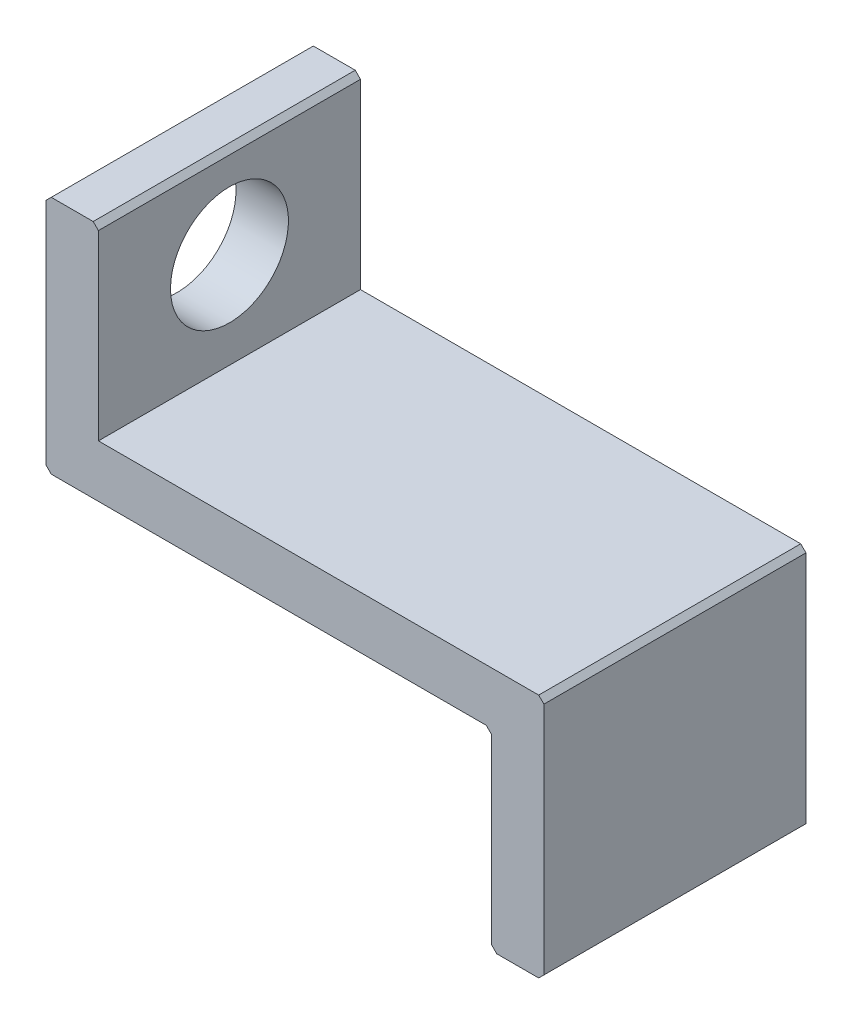
ISO-10303-21;
HEADER;
FILE_DESCRIPTION(('STEP AP214'),'2;1');
FILE_NAME('part.step','',(''),(''),'','','');
FILE_SCHEMA(('AUTOMOTIVE_DESIGN { 1 0 10303 214 1 1 1 1 }'));
ENDSEC;
DATA;
#1=APPLICATION_CONTEXT('core data for automotive mechanical design processes');
#2=APPLICATION_PROTOCOL_DEFINITION('international standard','automotive_design',2000,#1);
#3=PRODUCT_CONTEXT('',#1,'mechanical');
#4=PRODUCT('Part','Part','',(#3));
#5=PRODUCT_RELATED_PRODUCT_CATEGORY('part','',(#4));
#6=PRODUCT_DEFINITION_FORMATION('','',#4);
#7=PRODUCT_DEFINITION_CONTEXT('part definition',#1,'design');
#8=PRODUCT_DEFINITION('design','',#6,#7);
#9=PRODUCT_DEFINITION_SHAPE('','',#8);
#10=(LENGTH_UNIT() NAMED_UNIT(*) SI_UNIT(.MILLI.,.METRE.));
#11=(NAMED_UNIT(*) PLANE_ANGLE_UNIT() SI_UNIT($,.RADIAN.));
#12=(NAMED_UNIT(*) SI_UNIT($,.STERADIAN.) SOLID_ANGLE_UNIT());
#13=UNCERTAINTY_MEASURE_WITH_UNIT(LENGTH_MEASURE(1.E-05),#10,'distance_accuracy_value','');
#14=(GEOMETRIC_REPRESENTATION_CONTEXT(3) GLOBAL_UNCERTAINTY_ASSIGNED_CONTEXT((#13)) GLOBAL_UNIT_ASSIGNED_CONTEXT((#10,
#11,#12)) REPRESENTATION_CONTEXT('',''));
#15=CARTESIAN_POINT('',(0.,0.,0.));
#16=DIRECTION('',(0.,0.,1.));
#17=DIRECTION('',(1.,0.,0.));
#18=AXIS2_PLACEMENT_3D('',#15,#16,#17);
#19=CARTESIAN_POINT('',(-17.,41.35,10.));
#20=DIRECTION('',(-1.,0.,0.));
#21=DIRECTION('',(0.,0.,1.));
#22=AXIS2_PLACEMENT_3D('',#19,#20,#21);
#23=PLANE('',#22);
#24=CARTESIAN_POINT('',(-17.,45.,4.99999999999999));
#25=DIRECTION('',(-1.,0.,0.));
#26=DIRECTION('',(0.,0.,1.));
#27=AXIS2_PLACEMENT_3D('',#24,#25,#26);
#28=CIRCLE('',#27,2.24999999999999);
#29=CARTESIAN_POINT('',(-17.,45.,7.24999999999999));
#30=VERTEX_POINT('',#29);
#31=EDGE_CURVE('E170',#30,#30,#28,.T.);
#32=ORIENTED_EDGE('',*,*,#31,.T.);
#33=EDGE_LOOP('',(#32));
#34=FACE_BOUND('',#33,.T.);
#35=DIRECTION('',(0.,1.,0.));
#36=VECTOR('',#35,1.);
#37=CARTESIAN_POINT('',(-17.,41.35,0.));
#38=LINE('',#37,#36);
#39=CARTESIAN_POINT('',(-17.,41.35,0.));
#40=VERTEX_POINT('',#39);
#41=CARTESIAN_POINT('',(-17.,48.3,0.));
#42=VERTEX_POINT('',#41);
#43=EDGE_CURVE('E185',#40,#42,#38,.T.);
#44=ORIENTED_EDGE('',*,*,#43,.T.);
#45=DIRECTION('',(0.,0.,1.));
#46=VECTOR('',#45,1.);
#47=CARTESIAN_POINT('',(-17.,48.3,10.));
#48=LINE('',#47,#46);
#49=CARTESIAN_POINT('',(-17.,48.3,10.));
#50=VERTEX_POINT('',#49);
#51=EDGE_CURVE('E162',#42,#50,#48,.T.);
#52=ORIENTED_EDGE('',*,*,#51,.T.);
#53=DIRECTION('',(0.,1.,0.));
#54=VECTOR('',#53,1.);
#55=CARTESIAN_POINT('',(-17.,41.35,10.));
#56=LINE('',#55,#54);
#57=CARTESIAN_POINT('',(-17.,41.35,10.));
#58=VERTEX_POINT('',#57);
#59=EDGE_CURVE('E144',#58,#50,#56,.T.);
#60=ORIENTED_EDGE('',*,*,#59,.F.);
#61=DIRECTION('',(0.,0.,-1.));
#62=VECTOR('',#61,1.);
#63=CARTESIAN_POINT('',(-17.,41.35,10.));
#64=LINE('',#63,#62);
#65=EDGE_CURVE('E149',#58,#40,#64,.T.);
#66=ORIENTED_EDGE('',*,*,#65,.T.);
#67=EDGE_LOOP('',(#44,#52,#60,#66));
#68=FACE_BOUND('',#67,.T.);
#69=ADVANCED_FACE('F33',(#34,#68),#23,.F.);
#70=CARTESIAN_POINT('',(-17.,48.5,10.));
#71=DIRECTION('',(0.,-1.,0.));
#72=DIRECTION('',(0.,0.,-1.));
#73=AXIS2_PLACEMENT_3D('',#70,#71,#72);
#74=PLANE('',#73);
#75=DIRECTION('',(-1.,0.,0.));
#76=VECTOR('',#75,1.);
#77=CARTESIAN_POINT('',(-17.,48.5,0.));
#78=LINE('',#77,#76);
#79=CARTESIAN_POINT('',(-17.2,48.5,0.));
#80=VERTEX_POINT('',#79);
#81=CARTESIAN_POINT('',(-18.8,48.5,0.));
#82=VERTEX_POINT('',#81);
#83=EDGE_CURVE('E187',#80,#82,#78,.T.);
#84=ORIENTED_EDGE('',*,*,#83,.T.);
#85=DIRECTION('',(0.,0.,1.));
#86=VECTOR('',#85,1.);
#87=CARTESIAN_POINT('',(-18.8,48.5,10.));
#88=LINE('',#87,#86);
#89=CARTESIAN_POINT('',(-18.8,48.5,10.));
#90=VERTEX_POINT('',#89);
#91=EDGE_CURVE('E222',#82,#90,#88,.T.);
#92=ORIENTED_EDGE('',*,*,#91,.T.);
#93=DIRECTION('',(-1.,0.,0.));
#94=VECTOR('',#93,1.);
#95=CARTESIAN_POINT('',(-17.,48.5,10.));
#96=LINE('',#95,#94);
#97=CARTESIAN_POINT('',(-17.2,48.5,10.));
#98=VERTEX_POINT('',#97);
#99=EDGE_CURVE('E163',#98,#90,#96,.T.);
#100=ORIENTED_EDGE('',*,*,#99,.F.);
#101=DIRECTION('',(0.,0.,-1.));
#102=VECTOR('',#101,1.);
#103=CARTESIAN_POINT('',(-17.2,48.5,10.));
#104=LINE('',#103,#102);
#105=EDGE_CURVE('E219',#98,#80,#104,.T.);
#106=ORIENTED_EDGE('',*,*,#105,.T.);
#107=EDGE_LOOP('',(#84,#92,#100,#106));
#108=FACE_BOUND('',#107,.T.);
#109=ADVANCED_FACE('F300',(#108),#74,.F.);
#110=CARTESIAN_POINT('',(-19.,48.5,10.));
#111=DIRECTION('',(1.,0.,0.));
#112=DIRECTION('',(0.,0.,-1.));
#113=AXIS2_PLACEMENT_3D('',#110,#111,#112);
#114=PLANE('',#113);
#115=CARTESIAN_POINT('',(-19.,45.,4.99999999999999));
#116=DIRECTION('',(-1.,0.,0.));
#117=DIRECTION('',(0.,0.,1.));
#118=AXIS2_PLACEMENT_3D('',#115,#116,#117);
#119=CIRCLE('',#118,2.24999999999999);
#120=CARTESIAN_POINT('',(-19.,45.,7.24999999999998));
#121=VERTEX_POINT('',#120);
#122=EDGE_CURVE('E449',#121,#121,#119,.T.);
#123=ORIENTED_EDGE('',*,*,#122,.F.);
#124=EDGE_LOOP('',(#123));
#125=FACE_BOUND('',#124,.T.);
#126=DIRECTION('',(0.,-1.,0.));
#127=VECTOR('',#126,1.);
#128=CARTESIAN_POINT('',(-19.,48.5,10.));
#129=LINE('',#128,#127);
#130=CARTESIAN_POINT('',(-19.,48.3,10.));
#131=VERTEX_POINT('',#130);
#132=CARTESIAN_POINT('',(-19.,39.55,10.));
#133=VERTEX_POINT('',#132);
#134=EDGE_CURVE('E165',#131,#133,#129,.T.);
#135=ORIENTED_EDGE('',*,*,#134,.F.);
#136=DIRECTION('',(0.,0.,-1.));
#137=VECTOR('',#136,1.);
#138=CARTESIAN_POINT('',(-19.,48.3,10.));
#139=LINE('',#138,#137);
#140=CARTESIAN_POINT('',(-19.,48.3,0.));
#141=VERTEX_POINT('',#140);
#142=EDGE_CURVE('E204',#131,#141,#139,.T.);
#143=ORIENTED_EDGE('',*,*,#142,.T.);
#144=DIRECTION('',(0.,-1.,0.));
#145=VECTOR('',#144,1.);
#146=CARTESIAN_POINT('',(-19.,48.5,0.));
#147=LINE('',#146,#145);
#148=CARTESIAN_POINT('',(-19.,39.55,0.));
#149=VERTEX_POINT('',#148);
#150=EDGE_CURVE('E190',#141,#149,#147,.T.);
#151=ORIENTED_EDGE('',*,*,#150,.T.);
#152=DIRECTION('',(0.,0.,1.));
#153=VECTOR('',#152,1.);
#154=CARTESIAN_POINT('',(-19.,39.55,10.));
#155=LINE('',#154,#153);
#156=EDGE_CURVE('E159',#149,#133,#155,.T.);
#157=ORIENTED_EDGE('',*,*,#156,.T.);
#158=EDGE_LOOP('',(#135,#143,#151,#157));
#159=FACE_BOUND('',#158,.T.);
#160=ADVANCED_FACE('F306',(#125,#159),#114,.F.);
#161=CARTESIAN_POINT('',(-19.,39.35,10.));
#162=DIRECTION('',(0.,1.,0.));
#163=DIRECTION('',(0.,0.,1.));
#164=AXIS2_PLACEMENT_3D('',#161,#162,#163);
#165=PLANE('',#164);
#166=DIRECTION('',(1.,0.,0.));
#167=VECTOR('',#166,1.);
#168=CARTESIAN_POINT('',(-19.,39.35,10.));
#169=LINE('',#168,#167);
#170=CARTESIAN_POINT('',(-18.8,39.35,10.));
#171=VERTEX_POINT('',#170);
#172=CARTESIAN_POINT('',(-2.2,39.35,10.));
#173=VERTEX_POINT('',#172);
#174=EDGE_CURVE('E175',#171,#173,#169,.T.);
#175=ORIENTED_EDGE('',*,*,#174,.F.);
#176=DIRECTION('',(0.,0.,-1.));
#177=VECTOR('',#176,1.);
#178=CARTESIAN_POINT('',(-18.8,39.35,10.));
#179=LINE('',#178,#177);
#180=CARTESIAN_POINT('',(-18.8,39.35,0.));
#181=VERTEX_POINT('',#180);
#182=EDGE_CURVE('E237',#171,#181,#179,.T.);
#183=ORIENTED_EDGE('',*,*,#182,.T.);
#184=DIRECTION('',(1.,0.,0.));
#185=VECTOR('',#184,1.);
#186=CARTESIAN_POINT('',(-19.,39.35,0.));
#187=LINE('',#186,#185);
#188=CARTESIAN_POINT('',(-2.2,39.35,0.));
#189=VERTEX_POINT('',#188);
#190=EDGE_CURVE('E193',#181,#189,#187,.T.);
#191=ORIENTED_EDGE('',*,*,#190,.T.);
#192=DIRECTION('',(0.,0.,1.));
#193=VECTOR('',#192,1.);
#194=CARTESIAN_POINT('',(-2.2,39.35,10.));
#195=LINE('',#194,#193);
#196=EDGE_CURVE('E235',#189,#173,#195,.T.);
#197=ORIENTED_EDGE('',*,*,#196,.T.);
#198=EDGE_LOOP('',(#175,#183,#191,#197));
#199=FACE_BOUND('',#198,.T.);
#200=ADVANCED_FACE('F266',(#199),#165,.F.);
#201=CARTESIAN_POINT('',(-2.,39.35,10.));
#202=DIRECTION('',(1.,0.,0.));
#203=DIRECTION('',(0.,1.,0.));
#204=AXIS2_PLACEMENT_3D('',#201,#202,#203);
#205=PLANE('',#204);
#206=DIRECTION('',(0.,-1.,0.));
#207=VECTOR('',#206,1.);
#208=CARTESIAN_POINT('',(-2.,39.35,10.));
#209=LINE('',#208,#207);
#210=CARTESIAN_POINT('',(-2.,39.15,10.));
#211=VERTEX_POINT('',#210);
#212=CARTESIAN_POINT('',(-2.,32.2,10.));
#213=VERTEX_POINT('',#212);
#214=EDGE_CURVE('E178',#211,#213,#209,.T.);
#215=ORIENTED_EDGE('',*,*,#214,.F.);
#216=DIRECTION('',(0.,0.,-1.));
#217=VECTOR('',#216,1.);
#218=CARTESIAN_POINT('',(-2.,39.15,0.));
#219=LINE('',#218,#217);
#220=CARTESIAN_POINT('',(-2.,39.15,0.));
#221=VERTEX_POINT('',#220);
#222=EDGE_CURVE('E242',#211,#221,#219,.T.);
#223=ORIENTED_EDGE('',*,*,#222,.T.);
#224=DIRECTION('',(0.,-1.,0.));
#225=VECTOR('',#224,1.);
#226=CARTESIAN_POINT('',(-2.,39.35,0.));
#227=LINE('',#226,#225);
#228=CARTESIAN_POINT('',(-2.,32.2,0.));
#229=VERTEX_POINT('',#228);
#230=EDGE_CURVE('E196',#221,#229,#227,.T.);
#231=ORIENTED_EDGE('',*,*,#230,.T.);
#232=DIRECTION('',(0.,0.,1.));
#233=VECTOR('',#232,1.);
#234=CARTESIAN_POINT('',(-2.,32.2,10.));
#235=LINE('',#234,#233);
#236=EDGE_CURVE('E240',#229,#213,#235,.T.);
#237=ORIENTED_EDGE('',*,*,#236,.T.);
#238=EDGE_LOOP('',(#215,#223,#231,#237));
#239=FACE_BOUND('',#238,.T.);
#240=ADVANCED_FACE('F273',(#239),#205,.F.);
#241=CARTESIAN_POINT('',(-2.,32.,10.));
#242=DIRECTION('',(0.,1.,0.));
#243=DIRECTION('',(0.,0.,1.));
#244=AXIS2_PLACEMENT_3D('',#241,#242,#243);
#245=PLANE('',#244);
#246=DIRECTION('',(1.,0.,0.));
#247=VECTOR('',#246,1.);
#248=CARTESIAN_POINT('',(-2.,32.,10.));
#249=LINE('',#248,#247);
#250=CARTESIAN_POINT('',(-1.8,32.,10.));
#251=VERTEX_POINT('',#250);
#252=CARTESIAN_POINT('',(-0.199999999999999,32.,10.));
#253=VERTEX_POINT('',#252);
#254=EDGE_CURVE('E181',#251,#253,#249,.T.);
#255=ORIENTED_EDGE('',*,*,#254,.F.);
#256=DIRECTION('',(0.,0.,-1.));
#257=VECTOR('',#256,1.);
#258=CARTESIAN_POINT('',(-1.8,32.,10.));
#259=LINE('',#258,#257);
#260=CARTESIAN_POINT('',(-1.8,32.,0.));
#261=VERTEX_POINT('',#260);
#262=EDGE_CURVE('E254',#251,#261,#259,.T.);
#263=ORIENTED_EDGE('',*,*,#262,.T.);
#264=DIRECTION('',(1.,0.,0.));
#265=VECTOR('',#264,1.);
#266=CARTESIAN_POINT('',(-2.,32.,0.));
#267=LINE('',#266,#265);
#268=CARTESIAN_POINT('',(-0.199999999999999,32.,0.));
#269=VERTEX_POINT('',#268);
#270=EDGE_CURVE('E199',#261,#269,#267,.T.);
#271=ORIENTED_EDGE('',*,*,#270,.T.);
#272=DIRECTION('',(0.,0.,1.));
#273=VECTOR('',#272,1.);
#274=CARTESIAN_POINT('',(-0.199999999999999,32.,10.));
#275=LINE('',#274,#273);
#276=EDGE_CURVE('E252',#269,#253,#275,.T.);
#277=ORIENTED_EDGE('',*,*,#276,.T.);
#278=EDGE_LOOP('',(#255,#263,#271,#277));
#279=FACE_BOUND('',#278,.T.);
#280=ADVANCED_FACE('F281',(#279),#245,.F.);
#281=CARTESIAN_POINT('',(0.,32.,10.));
#282=DIRECTION('',(-1.,0.,0.));
#283=DIRECTION('',(0.,0.,1.));
#284=AXIS2_PLACEMENT_3D('',#281,#282,#283);
#285=PLANE('',#284);
#286=DIRECTION('',(0.,1.,0.));
#287=VECTOR('',#286,1.);
#288=CARTESIAN_POINT('',(0.,32.,0.));
#289=LINE('',#288,#287);
#290=CARTESIAN_POINT('',(0.,32.2,0.));
#291=VERTEX_POINT('',#290);
#292=CARTESIAN_POINT('',(0.,41.15,0.));
#293=VERTEX_POINT('',#292);
#294=EDGE_CURVE('E167',#291,#293,#289,.T.);
#295=ORIENTED_EDGE('',*,*,#294,.T.);
#296=DIRECTION('',(0.,0.,1.));
#297=VECTOR('',#296,1.);
#298=CARTESIAN_POINT('',(0.,41.15,10.));
#299=LINE('',#298,#297);
#300=CARTESIAN_POINT('',(0.,41.15,10.));
#301=VERTEX_POINT('',#300);
#302=EDGE_CURVE('E56',#293,#301,#299,.T.);
#303=ORIENTED_EDGE('',*,*,#302,.T.);
#304=DIRECTION('',(0.,1.,0.));
#305=VECTOR('',#304,1.);
#306=CARTESIAN_POINT('',(0.,32.,10.));
#307=LINE('',#306,#305);
#308=CARTESIAN_POINT('',(0.,32.2,10.));
#309=VERTEX_POINT('',#308);
#310=EDGE_CURVE('E150',#309,#301,#307,.T.);
#311=ORIENTED_EDGE('',*,*,#310,.F.);
#312=DIRECTION('',(0.,0.,-1.));
#313=VECTOR('',#312,1.);
#314=CARTESIAN_POINT('',(0.,32.2,10.));
#315=LINE('',#314,#313);
#316=EDGE_CURVE('E248',#309,#291,#315,.T.);
#317=ORIENTED_EDGE('',*,*,#316,.T.);
#318=EDGE_LOOP('',(#295,#303,#311,#317));
#319=FACE_BOUND('',#318,.T.);
#320=ADVANCED_FACE('F286',(#319),#285,.F.);
#321=CARTESIAN_POINT('',(0.,41.35,10.));
#322=DIRECTION('',(0.,-1.,0.));
#323=DIRECTION('',(0.,0.,-1.));
#324=AXIS2_PLACEMENT_3D('',#321,#322,#323);
#325=PLANE('',#324);
#326=DIRECTION('',(-1.,0.,0.));
#327=VECTOR('',#326,1.);
#328=CARTESIAN_POINT('',(0.,41.35,10.));
#329=LINE('',#328,#327);
#330=CARTESIAN_POINT('',(-0.199999999999999,41.35,10.));
#331=VERTEX_POINT('',#330);
#332=EDGE_CURVE('E139',#331,#58,#329,.T.);
#333=ORIENTED_EDGE('',*,*,#332,.F.);
#334=DIRECTION('',(0.,0.,-1.));
#335=VECTOR('',#334,1.);
#336=CARTESIAN_POINT('',(-0.199999999999999,41.35,10.));
#337=LINE('',#336,#335);
#338=CARTESIAN_POINT('',(-0.199999999999999,41.35,0.));
#339=VERTEX_POINT('',#338);
#340=EDGE_CURVE('E246',#331,#339,#337,.T.);
#341=ORIENTED_EDGE('',*,*,#340,.T.);
#342=DIRECTION('',(-1.,0.,0.));
#343=VECTOR('',#342,1.);
#344=CARTESIAN_POINT('',(0.,41.35,0.));
#345=LINE('',#344,#343);
#346=EDGE_CURVE('E155',#339,#40,#345,.T.);
#347=ORIENTED_EDGE('',*,*,#346,.T.);
#348=ORIENTED_EDGE('',*,*,#65,.F.);
#349=EDGE_LOOP('',(#333,#341,#347,#348));
#350=FACE_BOUND('',#349,.T.);
#351=ADVANCED_FACE('F153',(#350),#325,.F.);
#352=CARTESIAN_POINT('',(0.,0.,10.));
#353=DIRECTION('',(0.,0.,1.));
#354=DIRECTION('',(1.,0.,0.));
#355=AXIS2_PLACEMENT_3D('',#352,#353,#354);
#356=PLANE('',#355);
#357=ORIENTED_EDGE('',*,*,#99,.T.);
#358=DIRECTION('',(0.707106781186554,0.707106781186541,0.));
#359=VECTOR('',#358,1.);
#360=CARTESIAN_POINT('',(-33.6499999999998,33.6500000000004,10.));
#361=LINE('',#360,#359);
#362=EDGE_CURVE('E233',#90,#131,#361,.F.);
#363=ORIENTED_EDGE('',*,*,#362,.T.);
#364=ORIENTED_EDGE('',*,*,#134,.T.);
#365=DIRECTION('',(-0.707106781186541,0.707106781186554,0.));
#366=VECTOR('',#365,1.);
#367=CARTESIAN_POINT('',(10.2749999999998,10.2749999999997,10.));
#368=LINE('',#367,#366);
#369=EDGE_CURVE('E231',#133,#171,#368,.F.);
#370=ORIENTED_EDGE('',*,*,#369,.T.);
#371=ORIENTED_EDGE('',*,*,#174,.T.);
#372=DIRECTION('',(-0.707106781186555,0.70710678118654,0.));
#373=VECTOR('',#372,1.);
#374=CARTESIAN_POINT('',(-2.,39.15,10.));
#375=LINE('',#374,#373);
#376=EDGE_CURVE('E11',#173,#211,#375,.F.);
#377=ORIENTED_EDGE('',*,*,#376,.T.);
#378=ORIENTED_EDGE('',*,*,#214,.T.);
#379=DIRECTION('',(-0.707106781186535,0.70710678118656,0.));
#380=VECTOR('',#379,1.);
#381=CARTESIAN_POINT('',(15.1,15.0999999999994,10.));
#382=LINE('',#381,#380);
#383=EDGE_CURVE('E226',#213,#251,#382,.F.);
#384=ORIENTED_EDGE('',*,*,#383,.T.);
#385=ORIENTED_EDGE('',*,*,#254,.T.);
#386=DIRECTION('',(-0.707106781186548,-0.707106781186548,0.));
#387=VECTOR('',#386,1.);
#388=CARTESIAN_POINT('',(-16.1,16.1,10.));
#389=LINE('',#388,#387);
#390=EDGE_CURVE('E224',#253,#309,#389,.F.);
#391=ORIENTED_EDGE('',*,*,#390,.T.);
#392=ORIENTED_EDGE('',*,*,#310,.T.);
#393=DIRECTION('',(0.707106781186548,-0.707106781186548,0.));
#394=VECTOR('',#393,1.);
#395=CARTESIAN_POINT('',(20.575,20.575,10.));
#396=LINE('',#395,#394);
#397=EDGE_CURVE('E48',#301,#331,#396,.F.);
#398=ORIENTED_EDGE('',*,*,#397,.T.);
#399=ORIENTED_EDGE('',*,*,#332,.T.);
#400=ORIENTED_EDGE('',*,*,#59,.T.);
#401=DIRECTION('',(0.707106781186548,-0.707106781186548,0.));
#402=VECTOR('',#401,1.);
#403=CARTESIAN_POINT('',(15.65,15.65,10.));
#404=LINE('',#403,#402);
#405=EDGE_CURVE('E229',#50,#98,#404,.F.);
#406=ORIENTED_EDGE('',*,*,#405,.T.);
#407=EDGE_LOOP('',(#357,#363,#364,#370,#371,#377,#378,#384,#385,#391,#392,#398,#399,#400,#406));
#408=FACE_BOUND('',#407,.T.);
#409=ADVANCED_FACE('F142',(#408),#356,.T.);
#410=CARTESIAN_POINT('',(0.,0.,0.));
#411=DIRECTION('',(0.,0.,1.));
#412=DIRECTION('',(1.,0.,0.));
#413=AXIS2_PLACEMENT_3D('',#410,#411,#412);
#414=PLANE('',#413);
#415=ORIENTED_EDGE('',*,*,#150,.F.);
#416=DIRECTION('',(-0.707106781186554,-0.707106781186541,0.));
#417=VECTOR('',#416,1.);
#418=CARTESIAN_POINT('',(-19.,48.3,0.));
#419=LINE('',#418,#417);
#420=EDGE_CURVE('E217',#141,#82,#419,.F.);
#421=ORIENTED_EDGE('',*,*,#420,.T.);
#422=ORIENTED_EDGE('',*,*,#83,.F.);
#423=DIRECTION('',(-0.707106781186548,0.707106781186548,0.));
#424=VECTOR('',#423,1.);
#425=CARTESIAN_POINT('',(-17.2,48.5,0.));
#426=LINE('',#425,#424);
#427=EDGE_CURVE('E213',#80,#42,#426,.F.);
#428=ORIENTED_EDGE('',*,*,#427,.T.);
#429=ORIENTED_EDGE('',*,*,#43,.F.);
#430=ORIENTED_EDGE('',*,*,#346,.F.);
#431=DIRECTION('',(-0.707106781186548,0.707106781186548,0.));
#432=VECTOR('',#431,1.);
#433=CARTESIAN_POINT('',(-0.199999999999999,41.35,0.));
#434=LINE('',#433,#432);
#435=EDGE_CURVE('E211',#339,#293,#434,.F.);
#436=ORIENTED_EDGE('',*,*,#435,.T.);
#437=ORIENTED_EDGE('',*,*,#294,.F.);
#438=DIRECTION('',(0.707106781186548,0.707106781186548,0.));
#439=VECTOR('',#438,1.);
#440=CARTESIAN_POINT('',(0.,32.2,0.));
#441=LINE('',#440,#439);
#442=EDGE_CURVE('E207',#291,#269,#441,.F.);
#443=ORIENTED_EDGE('',*,*,#442,.T.);
#444=ORIENTED_EDGE('',*,*,#270,.F.);
#445=DIRECTION('',(0.707106781186535,-0.70710678118656,0.));
#446=VECTOR('',#445,1.);
#447=CARTESIAN_POINT('',(-1.8,32.,0.));
#448=LINE('',#447,#446);
#449=EDGE_CURVE('E209',#261,#229,#448,.F.);
#450=ORIENTED_EDGE('',*,*,#449,.T.);
#451=ORIENTED_EDGE('',*,*,#230,.F.);
#452=DIRECTION('',(0.707106781186555,-0.70710678118654,0.));
#453=VECTOR('',#452,1.);
#454=CARTESIAN_POINT('',(18.575,18.5750000000004,0.));
#455=LINE('',#454,#453);
#456=EDGE_CURVE('E41',#221,#189,#455,.F.);
#457=ORIENTED_EDGE('',*,*,#456,.T.);
#458=ORIENTED_EDGE('',*,*,#190,.F.);
#459=DIRECTION('',(0.707106781186541,-0.707106781186554,0.));
#460=VECTOR('',#459,1.);
#461=CARTESIAN_POINT('',(-18.8,39.35,0.));
#462=LINE('',#461,#460);
#463=EDGE_CURVE('E215',#181,#149,#462,.F.);
#464=ORIENTED_EDGE('',*,*,#463,.T.);
#465=EDGE_LOOP('',(#415,#421,#422,#428,#429,#430,#436,#437,#443,#444,#450,#451,#457,#458,#464));
#466=FACE_BOUND('',#465,.T.);
#467=ADVANCED_FACE('F260',(#466),#414,.F.);
#468=CARTESIAN_POINT('',(-19.,48.3,10.));
#469=DIRECTION('',(0.707106781186541,-0.707106781186554,0.));
#470=DIRECTION('',(0.,0.,-1.));
#471=AXIS2_PLACEMENT_3D('',#468,#469,#470);
#472=PLANE('',#471);
#473=ORIENTED_EDGE('',*,*,#362,.F.);
#474=ORIENTED_EDGE('',*,*,#91,.F.);
#475=ORIENTED_EDGE('',*,*,#420,.F.);
#476=ORIENTED_EDGE('',*,*,#142,.F.);
#477=EDGE_LOOP('',(#473,#474,#475,#476));
#478=FACE_BOUND('',#477,.T.);
#479=ADVANCED_FACE('F312',(#478),#472,.F.);
#480=CARTESIAN_POINT('',(-18.8,39.35,10.));
#481=DIRECTION('',(0.707106781186554,0.707106781186541,0.));
#482=DIRECTION('',(0.,0.,-1.));
#483=AXIS2_PLACEMENT_3D('',#480,#481,#482);
#484=PLANE('',#483);
#485=ORIENTED_EDGE('',*,*,#369,.F.);
#486=ORIENTED_EDGE('',*,*,#156,.F.);
#487=ORIENTED_EDGE('',*,*,#463,.F.);
#488=ORIENTED_EDGE('',*,*,#182,.F.);
#489=EDGE_LOOP('',(#485,#486,#487,#488));
#490=FACE_BOUND('',#489,.T.);
#491=ADVANCED_FACE('F315',(#490),#484,.F.);
#492=CARTESIAN_POINT('',(-2.,39.15,10.));
#493=DIRECTION('',(-0.70710678118654,-0.707106781186555,0.));
#494=DIRECTION('',(0.,0.,1.));
#495=AXIS2_PLACEMENT_3D('',#492,#493,#494);
#496=PLANE('',#495);
#497=ORIENTED_EDGE('',*,*,#376,.F.);
#498=ORIENTED_EDGE('',*,*,#196,.F.);
#499=ORIENTED_EDGE('',*,*,#456,.F.);
#500=ORIENTED_EDGE('',*,*,#222,.F.);
#501=EDGE_LOOP('',(#497,#498,#499,#500));
#502=FACE_BOUND('',#501,.T.);
#503=ADVANCED_FACE('F269',(#502),#496,.T.);
#504=CARTESIAN_POINT('',(-17.2,48.5,10.));
#505=DIRECTION('',(-0.707106781186548,-0.707106781186548,0.));
#506=DIRECTION('',(0.,0.,-1.));
#507=AXIS2_PLACEMENT_3D('',#504,#505,#506);
#508=PLANE('',#507);
#509=ORIENTED_EDGE('',*,*,#405,.F.);
#510=ORIENTED_EDGE('',*,*,#51,.F.);
#511=ORIENTED_EDGE('',*,*,#427,.F.);
#512=ORIENTED_EDGE('',*,*,#105,.F.);
#513=EDGE_LOOP('',(#509,#510,#511,#512));
#514=FACE_BOUND('',#513,.T.);
#515=ADVANCED_FACE('F291',(#514),#508,.F.);
#516=CARTESIAN_POINT('',(-0.199999999999999,41.35,10.));
#517=DIRECTION('',(-0.707106781186548,-0.707106781186548,0.));
#518=DIRECTION('',(0.,0.,-1.));
#519=AXIS2_PLACEMENT_3D('',#516,#517,#518);
#520=PLANE('',#519);
#521=ORIENTED_EDGE('',*,*,#397,.F.);
#522=ORIENTED_EDGE('',*,*,#302,.F.);
#523=ORIENTED_EDGE('',*,*,#435,.F.);
#524=ORIENTED_EDGE('',*,*,#340,.F.);
#525=EDGE_LOOP('',(#521,#522,#523,#524));
#526=FACE_BOUND('',#525,.T.);
#527=ADVANCED_FACE('F289',(#526),#520,.F.);
#528=CARTESIAN_POINT('',(-1.8,32.,10.));
#529=DIRECTION('',(0.70710678118656,0.707106781186535,0.));
#530=DIRECTION('',(0.,0.,-1.));
#531=AXIS2_PLACEMENT_3D('',#528,#529,#530);
#532=PLANE('',#531);
#533=ORIENTED_EDGE('',*,*,#383,.F.);
#534=ORIENTED_EDGE('',*,*,#236,.F.);
#535=ORIENTED_EDGE('',*,*,#449,.F.);
#536=ORIENTED_EDGE('',*,*,#262,.F.);
#537=EDGE_LOOP('',(#533,#534,#535,#536));
#538=FACE_BOUND('',#537,.T.);
#539=ADVANCED_FACE('F276',(#538),#532,.F.);
#540=CARTESIAN_POINT('',(0.,32.2,10.));
#541=DIRECTION('',(-0.707106781186548,0.707106781186548,0.));
#542=DIRECTION('',(0.,0.,-1.));
#543=AXIS2_PLACEMENT_3D('',#540,#541,#542);
#544=PLANE('',#543);
#545=ORIENTED_EDGE('',*,*,#390,.F.);
#546=ORIENTED_EDGE('',*,*,#276,.F.);
#547=ORIENTED_EDGE('',*,*,#442,.F.);
#548=ORIENTED_EDGE('',*,*,#316,.F.);
#549=EDGE_LOOP('',(#545,#546,#547,#548));
#550=FACE_BOUND('',#549,.T.);
#551=ADVANCED_FACE('F35',(#550),#544,.F.);
#552=CARTESIAN_POINT('',(-19.,45.,4.99999999999999));
#553=DIRECTION('',(-1.,0.,0.));
#554=DIRECTION('',(0.,0.,1.));
#555=AXIS2_PLACEMENT_3D('',#552,#553,#554);
#556=CYLINDRICAL_SURFACE('',#555,2.24999999999999);
#557=ORIENTED_EDGE('',*,*,#122,.T.);
#558=EDGE_LOOP('',(#557));
#559=FACE_BOUND('',#558,.T.);
#560=ORIENTED_EDGE('',*,*,#31,.F.);
#561=EDGE_LOOP('',(#560));
#562=FACE_BOUND('',#561,.T.);
#563=ADVANCED_FACE('F347',(#559,#562),#556,.F.);
#564=CLOSED_SHELL('',(#69,#109,#160,#200,#240,#280,#320,#351,#409,#467,#479,#491,#503,#515,#527,
#539,#551,#563));
#565=MANIFOLD_SOLID_BREP('B2',#564);
#566=ADVANCED_BREP_SHAPE_REPRESENTATION('',(#18,#565),#14);
#567=SHAPE_DEFINITION_REPRESENTATION(#9,#566);
ENDSEC;
END-ISO-10303-21;
